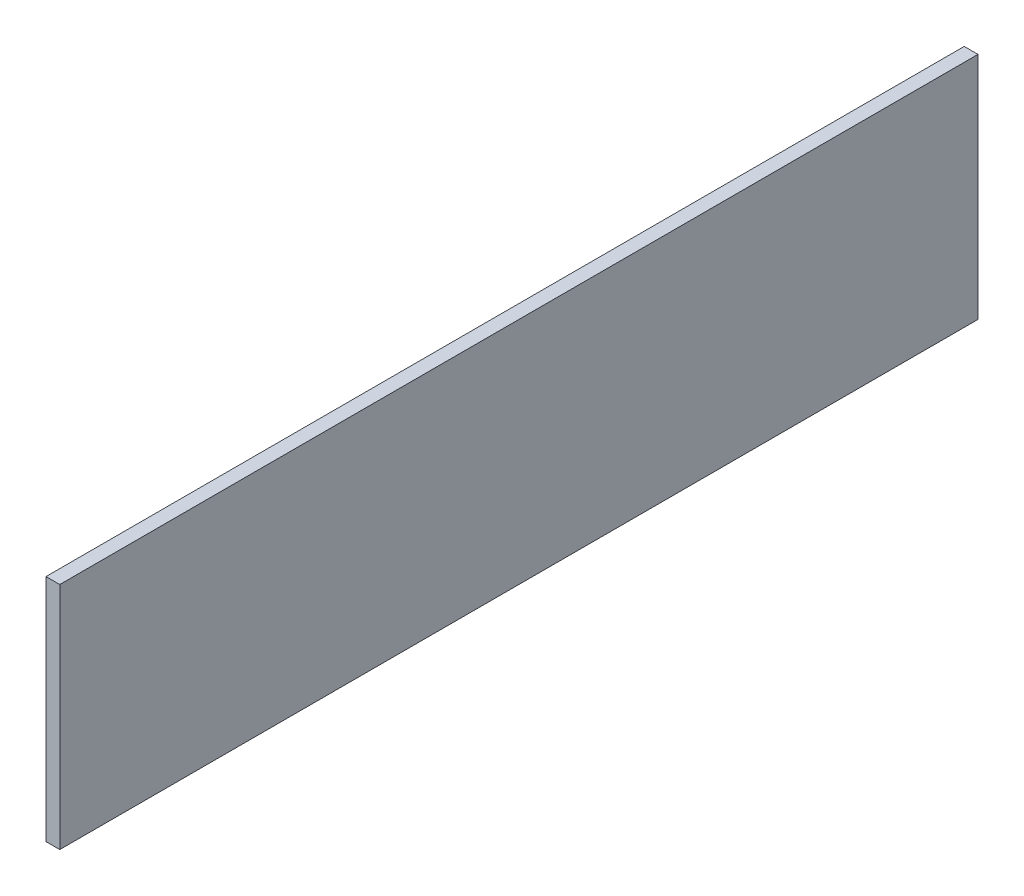
ISO-10303-21;
HEADER;
FILE_DESCRIPTION(('STEP AP214'),'2;1');
FILE_NAME('part.step','',(''),(''),'','','');
FILE_SCHEMA(('AUTOMOTIVE_DESIGN { 1 0 10303 214 1 1 1 1 }'));
ENDSEC;
DATA;
#1=APPLICATION_CONTEXT('core data for automotive mechanical design processes');
#2=APPLICATION_PROTOCOL_DEFINITION('international standard','automotive_design',2000,#1);
#3=PRODUCT_CONTEXT('',#1,'mechanical');
#4=PRODUCT('Part','Part','',(#3));
#5=PRODUCT_RELATED_PRODUCT_CATEGORY('part','',(#4));
#6=PRODUCT_DEFINITION_FORMATION('','',#4);
#7=PRODUCT_DEFINITION_CONTEXT('part definition',#1,'design');
#8=PRODUCT_DEFINITION('design','',#6,#7);
#9=PRODUCT_DEFINITION_SHAPE('','',#8);
#10=(LENGTH_UNIT() NAMED_UNIT(*) SI_UNIT(.MILLI.,.METRE.));
#11=(NAMED_UNIT(*) PLANE_ANGLE_UNIT() SI_UNIT($,.RADIAN.));
#12=(NAMED_UNIT(*) SI_UNIT($,.STERADIAN.) SOLID_ANGLE_UNIT());
#13=UNCERTAINTY_MEASURE_WITH_UNIT(LENGTH_MEASURE(1.E-05),#10,'distance_accuracy_value','');
#14=(GEOMETRIC_REPRESENTATION_CONTEXT(3) GLOBAL_UNCERTAINTY_ASSIGNED_CONTEXT((#13)) GLOBAL_UNIT_ASSIGNED_CONTEXT((#10,
#11,#12)) REPRESENTATION_CONTEXT('',''));
#15=CARTESIAN_POINT('',(0.,0.,0.));
#16=DIRECTION('',(0.,0.,1.));
#17=DIRECTION('',(1.,0.,0.));
#18=AXIS2_PLACEMENT_3D('',#15,#16,#17);
#19=CARTESIAN_POINT('',(3.,0.,-100.));
#20=DIRECTION('',(0.,0.,-1.));
#21=DIRECTION('',(-1.,0.,0.));
#22=AXIS2_PLACEMENT_3D('',#19,#20,#21);
#23=PLANE('',#22);
#24=DIRECTION('',(0.,-1.,0.));
#25=VECTOR('',#24,1.);
#26=CARTESIAN_POINT('',(0.,0.,-100.));
#27=LINE('',#26,#25);
#28=CARTESIAN_POINT('',(0.,25.,-100.));
#29=VERTEX_POINT('',#28);
#30=CARTESIAN_POINT('',(0.,-25.,-100.));
#31=VERTEX_POINT('',#30);
#32=EDGE_CURVE('E100',#29,#31,#27,.T.);
#33=ORIENTED_EDGE('',*,*,#32,.F.);
#34=DIRECTION('',(-1.,0.,0.));
#35=VECTOR('',#34,1.);
#36=CARTESIAN_POINT('',(3.,25.,-100.));
#37=LINE('',#36,#35);
#38=CARTESIAN_POINT('',(3.,25.,-100.));
#39=VERTEX_POINT('',#38);
#40=EDGE_CURVE('E11',#39,#29,#37,.T.);
#41=ORIENTED_EDGE('',*,*,#40,.F.);
#42=DIRECTION('',(0.,-1.,0.));
#43=VECTOR('',#42,1.);
#44=CARTESIAN_POINT('',(3.,0.,-100.));
#45=LINE('',#44,#43);
#46=CARTESIAN_POINT('',(3.,-25.,-100.));
#47=VERTEX_POINT('',#46);
#48=EDGE_CURVE('E94',#39,#47,#45,.T.);
#49=ORIENTED_EDGE('',*,*,#48,.T.);
#50=DIRECTION('',(-1.,0.,0.));
#51=VECTOR('',#50,1.);
#52=CARTESIAN_POINT('',(3.,-25.,-100.));
#53=LINE('',#52,#51);
#54=EDGE_CURVE('E75',#47,#31,#53,.T.);
#55=ORIENTED_EDGE('',*,*,#54,.T.);
#56=EDGE_LOOP('',(#33,#41,#49,#55));
#57=FACE_BOUND('',#56,.T.);
#58=ADVANCED_FACE('F37',(#57),#23,.T.);
#59=CARTESIAN_POINT('',(3.,25.,0.));
#60=DIRECTION('',(0.,1.,0.));
#61=DIRECTION('',(0.,0.,1.));
#62=AXIS2_PLACEMENT_3D('',#59,#60,#61);
#63=PLANE('',#62);
#64=DIRECTION('',(0.,0.,-1.));
#65=VECTOR('',#64,1.);
#66=CARTESIAN_POINT('',(0.,25.,0.));
#67=LINE('',#66,#65);
#68=CARTESIAN_POINT('',(0.,25.,100.));
#69=VERTEX_POINT('',#68);
#70=EDGE_CURVE('E88',#69,#29,#67,.T.);
#71=ORIENTED_EDGE('',*,*,#70,.F.);
#72=DIRECTION('',(-1.,0.,0.));
#73=VECTOR('',#72,1.);
#74=CARTESIAN_POINT('',(3.,25.,100.));
#75=LINE('',#74,#73);
#76=CARTESIAN_POINT('',(3.,25.,100.));
#77=VERTEX_POINT('',#76);
#78=EDGE_CURVE('E45',#77,#69,#75,.T.);
#79=ORIENTED_EDGE('',*,*,#78,.F.);
#80=DIRECTION('',(0.,0.,-1.));
#81=VECTOR('',#80,1.);
#82=CARTESIAN_POINT('',(3.,25.,0.));
#83=LINE('',#82,#81);
#84=EDGE_CURVE('E86',#77,#39,#83,.T.);
#85=ORIENTED_EDGE('',*,*,#84,.T.);
#86=ORIENTED_EDGE('',*,*,#40,.T.);
#87=EDGE_LOOP('',(#71,#79,#85,#86));
#88=FACE_BOUND('',#87,.T.);
#89=ADVANCED_FACE('F84',(#88),#63,.T.);
#90=CARTESIAN_POINT('',(3.,0.,100.));
#91=DIRECTION('',(0.,0.,-1.));
#92=DIRECTION('',(-1.,0.,0.));
#93=AXIS2_PLACEMENT_3D('',#90,#91,#92);
#94=PLANE('',#93);
#95=DIRECTION('',(0.,-1.,0.));
#96=VECTOR('',#95,1.);
#97=CARTESIAN_POINT('',(0.,0.,100.));
#98=LINE('',#97,#96);
#99=CARTESIAN_POINT('',(0.,-25.,100.));
#100=VERTEX_POINT('',#99);
#101=EDGE_CURVE('E68',#69,#100,#98,.T.);
#102=ORIENTED_EDGE('',*,*,#101,.T.);
#103=DIRECTION('',(-1.,0.,0.));
#104=VECTOR('',#103,1.);
#105=CARTESIAN_POINT('',(3.,-25.,100.));
#106=LINE('',#105,#104);
#107=CARTESIAN_POINT('',(3.,-25.,100.));
#108=VERTEX_POINT('',#107);
#109=EDGE_CURVE('E89',#108,#100,#106,.T.);
#110=ORIENTED_EDGE('',*,*,#109,.F.);
#111=DIRECTION('',(0.,-1.,0.));
#112=VECTOR('',#111,1.);
#113=CARTESIAN_POINT('',(3.,0.,100.));
#114=LINE('',#113,#112);
#115=EDGE_CURVE('E90',#77,#108,#114,.T.);
#116=ORIENTED_EDGE('',*,*,#115,.F.);
#117=ORIENTED_EDGE('',*,*,#78,.T.);
#118=EDGE_LOOP('',(#102,#110,#116,#117));
#119=FACE_BOUND('',#118,.T.);
#120=ADVANCED_FACE('F91',(#119),#94,.F.);
#121=CARTESIAN_POINT('',(3.,-25.,0.));
#122=DIRECTION('',(0.,1.,0.));
#123=DIRECTION('',(0.,0.,1.));
#124=AXIS2_PLACEMENT_3D('',#121,#122,#123);
#125=PLANE('',#124);
#126=DIRECTION('',(0.,0.,-1.));
#127=VECTOR('',#126,1.);
#128=CARTESIAN_POINT('',(0.,-25.,0.));
#129=LINE('',#128,#127);
#130=EDGE_CURVE('E96',#100,#31,#129,.T.);
#131=ORIENTED_EDGE('',*,*,#130,.T.);
#132=ORIENTED_EDGE('',*,*,#54,.F.);
#133=DIRECTION('',(0.,0.,-1.));
#134=VECTOR('',#133,1.);
#135=CARTESIAN_POINT('',(3.,-25.,0.));
#136=LINE('',#135,#134);
#137=EDGE_CURVE('E53',#108,#47,#136,.T.);
#138=ORIENTED_EDGE('',*,*,#137,.F.);
#139=ORIENTED_EDGE('',*,*,#109,.T.);
#140=EDGE_LOOP('',(#131,#132,#138,#139));
#141=FACE_BOUND('',#140,.T.);
#142=ADVANCED_FACE('F109',(#141),#125,.F.);
#143=CARTESIAN_POINT('',(3.,0.,0.));
#144=DIRECTION('',(1.,0.,0.));
#145=DIRECTION('',(0.,0.,-1.));
#146=AXIS2_PLACEMENT_3D('',#143,#144,#145);
#147=PLANE('',#146);
#148=ORIENTED_EDGE('',*,*,#48,.F.);
#149=ORIENTED_EDGE('',*,*,#84,.F.);
#150=ORIENTED_EDGE('',*,*,#115,.T.);
#151=ORIENTED_EDGE('',*,*,#137,.T.);
#152=EDGE_LOOP('',(#148,#149,#150,#151));
#153=FACE_BOUND('',#152,.T.);
#154=ADVANCED_FACE('F93',(#153),#147,.T.);
#155=CARTESIAN_POINT('',(0.,0.,0.));
#156=DIRECTION('',(1.,0.,0.));
#157=DIRECTION('',(0.,0.,-1.));
#158=AXIS2_PLACEMENT_3D('',#155,#156,#157);
#159=PLANE('',#158);
#160=ORIENTED_EDGE('',*,*,#32,.T.);
#161=ORIENTED_EDGE('',*,*,#130,.F.);
#162=ORIENTED_EDGE('',*,*,#101,.F.);
#163=ORIENTED_EDGE('',*,*,#70,.T.);
#164=EDGE_LOOP('',(#160,#161,#162,#163));
#165=FACE_BOUND('',#164,.T.);
#166=ADVANCED_FACE('F111',(#165),#159,.F.);
#167=CLOSED_SHELL('',(#58,#89,#120,#142,#154,#166));
#168=MANIFOLD_SOLID_BREP('B2',#167);
#169=ADVANCED_BREP_SHAPE_REPRESENTATION('',(#18,#168),#14);
#170=SHAPE_DEFINITION_REPRESENTATION(#9,#169);
ENDSEC;
END-ISO-10303-21;
